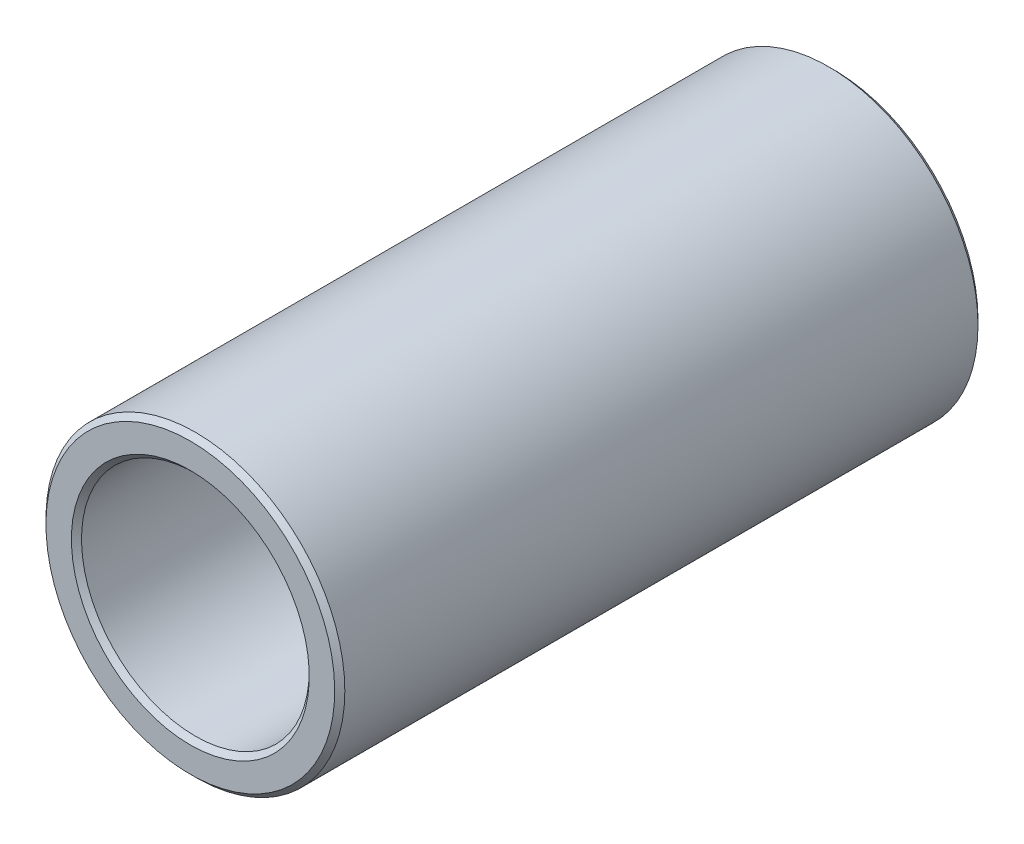
ISO-10303-21;
HEADER;
FILE_DESCRIPTION(('STEP AP214'),'2;1');
FILE_NAME('part.step','',(''),(''),'','','');
FILE_SCHEMA(('AUTOMOTIVE_DESIGN { 1 0 10303 214 1 1 1 1 }'));
ENDSEC;
DATA;
#1=APPLICATION_CONTEXT('core data for automotive mechanical design processes');
#2=APPLICATION_PROTOCOL_DEFINITION('international standard','automotive_design',2000,#1);
#3=PRODUCT_CONTEXT('',#1,'mechanical');
#4=PRODUCT('Part','Part','',(#3));
#5=PRODUCT_RELATED_PRODUCT_CATEGORY('part','',(#4));
#6=PRODUCT_DEFINITION_FORMATION('','',#4);
#7=PRODUCT_DEFINITION_CONTEXT('part definition',#1,'design');
#8=PRODUCT_DEFINITION('design','',#6,#7);
#9=PRODUCT_DEFINITION_SHAPE('','',#8);
#10=(LENGTH_UNIT() NAMED_UNIT(*) SI_UNIT(.MILLI.,.METRE.));
#11=(NAMED_UNIT(*) PLANE_ANGLE_UNIT() SI_UNIT($,.RADIAN.));
#12=(NAMED_UNIT(*) SI_UNIT($,.STERADIAN.) SOLID_ANGLE_UNIT());
#13=UNCERTAINTY_MEASURE_WITH_UNIT(LENGTH_MEASURE(1.E-05),#10,'distance_accuracy_value','');
#14=(GEOMETRIC_REPRESENTATION_CONTEXT(3) GLOBAL_UNCERTAINTY_ASSIGNED_CONTEXT((#13)) GLOBAL_UNIT_ASSIGNED_CONTEXT((#10,
#11,#12)) REPRESENTATION_CONTEXT('',''));
#15=CARTESIAN_POINT('',(0.,0.,0.));
#16=DIRECTION('',(0.,0.,1.));
#17=DIRECTION('',(1.,0.,0.));
#18=AXIS2_PLACEMENT_3D('',#15,#16,#17);
#19=CARTESIAN_POINT('',(0.,0.,7.37616));
#20=DIRECTION('',(0.,0.,1.));
#21=DIRECTION('',(1.,0.,0.));
#22=AXIS2_PLACEMENT_3D('',#19,#20,#21);
#23=CYLINDRICAL_SURFACE('',#22,2.2479);
#24=CARTESIAN_POINT('',(0.,0.,6.25000000002274));
#25=DIRECTION('',(0.,0.,1.));
#26=DIRECTION('',(1.,0.,0.));
#27=AXIS2_PLACEMENT_3D('',#24,#25,#26);
#28=CIRCLE('',#27,2.24790000004305);
#29=CARTESIAN_POINT('',(2.24790000004305,0.,6.25000000002274));
#30=VERTEX_POINT('',#29);
#31=EDGE_CURVE('E31',#30,#30,#28,.T.);
#32=ORIENTED_EDGE('',*,*,#31,.T.);
#33=EDGE_LOOP('',(#32));
#34=FACE_BOUND('',#33,.T.);
#35=CARTESIAN_POINT('',(0.,0.,-6.24999999996589));
#36=DIRECTION('',(0.,0.,-1.));
#37=DIRECTION('',(-1.,0.,0.));
#38=AXIS2_PLACEMENT_3D('',#35,#36,#37);
#39=CIRCLE('',#38,2.2478999999862);
#40=CARTESIAN_POINT('',(-2.2478999999862,0.,-6.24999999996589));
#41=VERTEX_POINT('',#40);
#42=EDGE_CURVE('E34',#41,#41,#39,.T.);
#43=ORIENTED_EDGE('',*,*,#42,.T.);
#44=EDGE_LOOP('',(#43));
#45=FACE_BOUND('',#44,.T.);
#46=ADVANCED_FACE('F16',(#34,#45),#23,.F.);
#47=CARTESIAN_POINT('',(0.,0.,-6.34999999994079));
#48=DIRECTION('',(0.,0.,-1.));
#49=DIRECTION('',(-1.,0.,0.));
#50=AXIS2_PLACEMENT_3D('',#47,#48,#49);
#51=CONICAL_SURFACE('',#50,2.34789999990426,0.785398163397448);
#52=CARTESIAN_POINT('',(0.,0.,-6.34999999999764));
#53=DIRECTION('',(0.,0.,-1.));
#54=DIRECTION('',(-1.,0.,0.));
#55=AXIS2_PLACEMENT_3D('',#52,#53,#54);
#56=CIRCLE('',#55,2.3478999999611);
#57=CARTESIAN_POINT('',(-2.3478999999611,0.,-6.34999999999764));
#58=VERTEX_POINT('',#57);
#59=EDGE_CURVE('E19',#58,#58,#56,.T.);
#60=ORIENTED_EDGE('',*,*,#59,.T.);
#61=EDGE_LOOP('',(#60));
#62=FACE_BOUND('',#61,.T.);
#63=ORIENTED_EDGE('',*,*,#42,.F.);
#64=EDGE_LOOP('',(#63));
#65=FACE_BOUND('',#64,.T.);
#66=ADVANCED_FACE('F48',(#62,#65),#51,.F.);
#67=CARTESIAN_POINT('',(0.,0.,6.34999999988395));
#68=DIRECTION('',(0.,0.,1.));
#69=DIRECTION('',(0.,-1.,0.));
#70=AXIS2_PLACEMENT_3D('',#67,#68,#69);
#71=CONICAL_SURFACE('',#70,2.34789999990426,0.785398163397448);
#72=CARTESIAN_POINT('',(0.,0.,6.34999999994079));
#73=DIRECTION('',(0.,0.,1.));
#74=DIRECTION('',(0.,-1.,0.));
#75=AXIS2_PLACEMENT_3D('',#72,#73,#74);
#76=CIRCLE('',#75,2.3478999999611);
#77=CARTESIAN_POINT('',(0.,-2.3478999999611,6.34999999994079));
#78=VERTEX_POINT('',#77);
#79=EDGE_CURVE('E41',#78,#78,#76,.T.);
#80=ORIENTED_EDGE('',*,*,#79,.T.);
#81=EDGE_LOOP('',(#80));
#82=FACE_BOUND('',#81,.T.);
#83=ORIENTED_EDGE('',*,*,#31,.F.);
#84=EDGE_LOOP('',(#83));
#85=FACE_BOUND('',#84,.T.);
#86=ADVANCED_FACE('F54',(#82,#85),#71,.F.);
#87=CARTESIAN_POINT('',(0.,2.95,-6.35));
#88=DIRECTION('',(0.,0.,1.));
#89=DIRECTION('',(1.,0.,0.));
#90=AXIS2_PLACEMENT_3D('',#87,#88,#89);
#91=PLANE('',#90);
#92=CARTESIAN_POINT('',(0.,0.,-6.35000000005448));
#93=DIRECTION('',(0.,0.,1.));
#94=DIRECTION('',(1.,0.,0.));
#95=AXIS2_PLACEMENT_3D('',#92,#93,#94);
#96=CIRCLE('',#95,2.84999999996671);
#97=CARTESIAN_POINT('',(2.84999999996671,0.,-6.35000000005448));
#98=VERTEX_POINT('',#97);
#99=EDGE_CURVE('E39',#98,#98,#96,.T.);
#100=ORIENTED_EDGE('',*,*,#99,.F.);
#101=EDGE_LOOP('',(#100));
#102=FACE_BOUND('',#101,.T.);
#103=ORIENTED_EDGE('',*,*,#59,.F.);
#104=EDGE_LOOP('',(#103));
#105=FACE_BOUND('',#104,.T.);
#106=ADVANCED_FACE('F51',(#102,#105),#91,.F.);
#107=CARTESIAN_POINT('',(0.,2.95,6.35));
#108=DIRECTION('',(0.,0.,-1.));
#109=DIRECTION('',(-1.,0.,0.));
#110=AXIS2_PLACEMENT_3D('',#107,#108,#109);
#111=PLANE('',#110);
#112=CARTESIAN_POINT('',(0.,0.,6.34999999999764));
#113=DIRECTION('',(0.,0.,-1.));
#114=DIRECTION('',(0.,1.,0.));
#115=AXIS2_PLACEMENT_3D('',#112,#113,#114);
#116=CIRCLE('',#115,2.8500000000804);
#117=CARTESIAN_POINT('',(0.,2.8500000000804,6.34999999999764));
#118=VERTEX_POINT('',#117);
#119=EDGE_CURVE('E28',#118,#118,#116,.T.);
#120=ORIENTED_EDGE('',*,*,#119,.F.);
#121=EDGE_LOOP('',(#120));
#122=FACE_BOUND('',#121,.T.);
#123=ORIENTED_EDGE('',*,*,#79,.F.);
#124=EDGE_LOOP('',(#123));
#125=FACE_BOUND('',#124,.T.);
#126=ADVANCED_FACE('F53',(#122,#125),#111,.F.);
#127=CARTESIAN_POINT('',(0.,0.,-6.25000000002274));
#128=DIRECTION('',(0.,0.,1.));
#129=DIRECTION('',(1.,0.,0.));
#130=AXIS2_PLACEMENT_3D('',#127,#128,#129);
#131=CONICAL_SURFACE('',#130,2.94999999999845,0.785398163397448);
#132=CARTESIAN_POINT('',(0.,0.,-6.25));
#133=DIRECTION('',(0.,0.,1.));
#134=DIRECTION('',(1.,0.,0.));
#135=AXIS2_PLACEMENT_3D('',#132,#133,#134);
#136=CIRCLE('',#135,2.95);
#137=CARTESIAN_POINT('',(2.95,0.,-6.25));
#138=VERTEX_POINT('',#137);
#139=EDGE_CURVE('E23',#138,#138,#136,.T.);
#140=ORIENTED_EDGE('',*,*,#139,.F.);
#141=EDGE_LOOP('',(#140));
#142=FACE_BOUND('',#141,.T.);
#143=ORIENTED_EDGE('',*,*,#99,.T.);
#144=EDGE_LOOP('',(#143));
#145=FACE_BOUND('',#144,.T.);
#146=ADVANCED_FACE('F62',(#142,#145),#131,.T.);
#147=CARTESIAN_POINT('',(0.,0.,6.25000000013642));
#148=DIRECTION('',(0.,0.,-1.));
#149=DIRECTION('',(0.,1.,0.));
#150=AXIS2_PLACEMENT_3D('',#147,#148,#149);
#151=CONICAL_SURFACE('',#150,2.94999999988477,0.785398163113231);
#152=CARTESIAN_POINT('',(0.,0.,6.25));
#153=DIRECTION('',(0.,0.,1.));
#154=DIRECTION('',(1.,0.,0.));
#155=AXIS2_PLACEMENT_3D('',#152,#153,#154);
#156=CIRCLE('',#155,2.95);
#157=CARTESIAN_POINT('',(2.95,0.,6.25));
#158=VERTEX_POINT('',#157);
#159=EDGE_CURVE('E10',#158,#158,#156,.F.);
#160=ORIENTED_EDGE('',*,*,#159,.F.);
#161=EDGE_LOOP('',(#160));
#162=FACE_BOUND('',#161,.T.);
#163=ORIENTED_EDGE('',*,*,#119,.T.);
#164=EDGE_LOOP('',(#163));
#165=FACE_BOUND('',#164,.T.);
#166=ADVANCED_FACE('F69',(#162,#165),#151,.T.);
#167=CARTESIAN_POINT('',(0.,0.,7.37616));
#168=DIRECTION('',(0.,0.,1.));
#169=DIRECTION('',(1.,0.,0.));
#170=AXIS2_PLACEMENT_3D('',#167,#168,#169);
#171=CYLINDRICAL_SURFACE('',#170,2.95);
#172=ORIENTED_EDGE('',*,*,#159,.T.);
#173=EDGE_LOOP('',(#172));
#174=FACE_BOUND('',#173,.T.);
#175=ORIENTED_EDGE('',*,*,#139,.T.);
#176=EDGE_LOOP('',(#175));
#177=FACE_BOUND('',#176,.T.);
#178=ADVANCED_FACE('F67',(#174,#177),#171,.T.);
#179=CLOSED_SHELL('',(#46,#66,#86,#106,#126,#146,#166,#178));
#180=MANIFOLD_SOLID_BREP('B1',#179);
#181=ADVANCED_BREP_SHAPE_REPRESENTATION('',(#18,#180),#14);
#182=SHAPE_DEFINITION_REPRESENTATION(#9,#181);
ENDSEC;
END-ISO-10303-21;
